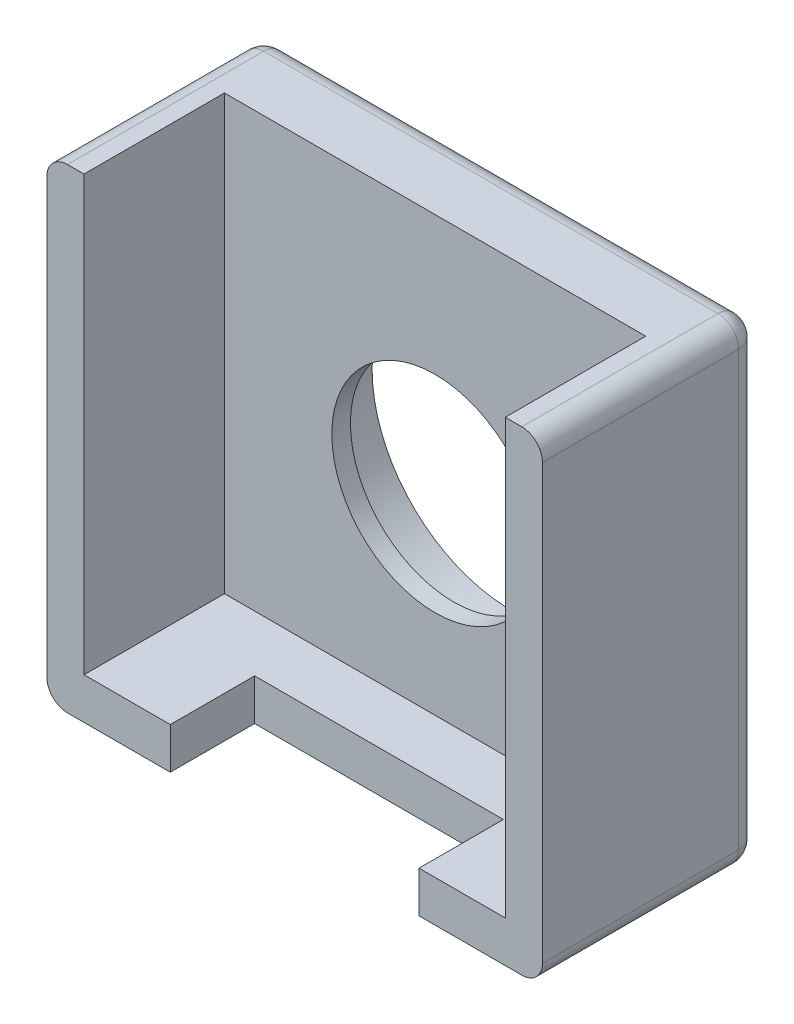
ISO-10303-21;
HEADER;
FILE_DESCRIPTION(('STEP AP214'),'2;1');
FILE_NAME('part.step','',(''),(''),'','','');
FILE_SCHEMA(('AUTOMOTIVE_DESIGN { 1 0 10303 214 1 1 1 1 }'));
ENDSEC;
DATA;
#1=APPLICATION_CONTEXT('core data for automotive mechanical design processes');
#2=APPLICATION_PROTOCOL_DEFINITION('international standard','automotive_design',2000,#1);
#3=PRODUCT_CONTEXT('',#1,'mechanical');
#4=PRODUCT('Part','Part','',(#3));
#5=PRODUCT_RELATED_PRODUCT_CATEGORY('part','',(#4));
#6=PRODUCT_DEFINITION_FORMATION('','',#4);
#7=PRODUCT_DEFINITION_CONTEXT('part definition',#1,'design');
#8=PRODUCT_DEFINITION('design','',#6,#7);
#9=PRODUCT_DEFINITION_SHAPE('','',#8);
#10=(LENGTH_UNIT() NAMED_UNIT(*) SI_UNIT(.MILLI.,.METRE.));
#11=(NAMED_UNIT(*) PLANE_ANGLE_UNIT() SI_UNIT($,.RADIAN.));
#12=(NAMED_UNIT(*) SI_UNIT($,.STERADIAN.) SOLID_ANGLE_UNIT());
#13=UNCERTAINTY_MEASURE_WITH_UNIT(LENGTH_MEASURE(1.E-05),#10,'distance_accuracy_value','');
#14=(GEOMETRIC_REPRESENTATION_CONTEXT(3) GLOBAL_UNCERTAINTY_ASSIGNED_CONTEXT((#13)) GLOBAL_UNIT_ASSIGNED_CONTEXT((#10,
#11,#12)) REPRESENTATION_CONTEXT('',''));
#15=CARTESIAN_POINT('',(0.,0.,0.));
#16=DIRECTION('',(0.,0.,1.));
#17=DIRECTION('',(1.,0.,0.));
#18=AXIS2_PLACEMENT_3D('',#15,#16,#17);
#19=CARTESIAN_POINT('',(0.,0.,0.));
#20=DIRECTION('',(0.,0.,-1.));
#21=DIRECTION('',(-1.,0.,0.));
#22=AXIS2_PLACEMENT_3D('',#19,#20,#21);
#23=PLANE('',#22);
#24=DIRECTION('',(0.,1.,0.));
#25=VECTOR('',#24,1.);
#26=CARTESIAN_POINT('',(24.,0.,0.));
#27=LINE('',#26,#25);
#28=CARTESIAN_POINT('',(24.,1.,0.));
#29=VERTEX_POINT('',#28);
#30=CARTESIAN_POINT('',(24.,22.,0.));
#31=VERTEX_POINT('',#30);
#32=EDGE_CURVE('E291',#29,#31,#27,.T.);
#33=ORIENTED_EDGE('',*,*,#32,.T.);
#34=CARTESIAN_POINT('',(23.,22.,0.));
#35=DIRECTION('',(0.,0.,-1.));
#36=DIRECTION('',(-1.,0.,0.));
#37=AXIS2_PLACEMENT_3D('',#34,#35,#36);
#38=CIRCLE('',#37,1.);
#39=CARTESIAN_POINT('',(23.,23.,0.));
#40=VERTEX_POINT('',#39);
#41=EDGE_CURVE('E272',#31,#40,#38,.F.);
#42=ORIENTED_EDGE('',*,*,#41,.T.);
#43=DIRECTION('',(1.,0.,0.));
#44=VECTOR('',#43,1.);
#45=CARTESIAN_POINT('',(0.,23.,0.));
#46=LINE('',#45,#44);
#47=CARTESIAN_POINT('',(22.2,23.,0.));
#48=VERTEX_POINT('',#47);
#49=EDGE_CURVE('E252',#48,#40,#46,.T.);
#50=ORIENTED_EDGE('',*,*,#49,.F.);
#51=DIRECTION('',(0.,1.,0.));
#52=VECTOR('',#51,1.);
#53=CARTESIAN_POINT('',(22.2,2.,0.));
#54=LINE('',#53,#52);
#55=CARTESIAN_POINT('',(22.2,2.,0.));
#56=VERTEX_POINT('',#55);
#57=EDGE_CURVE('E374',#56,#48,#54,.T.);
#58=ORIENTED_EDGE('',*,*,#57,.F.);
#59=DIRECTION('',(1.,0.,0.));
#60=VECTOR('',#59,1.);
#61=CARTESIAN_POINT('',(22.2,2.,0.));
#62=LINE('',#61,#60);
#63=CARTESIAN_POINT('',(18.0230350343251,2.,0.));
#64=VERTEX_POINT('',#63);
#65=EDGE_CURVE('E242',#64,#56,#62,.T.);
#66=ORIENTED_EDGE('',*,*,#65,.F.);
#67=DIRECTION('',(0.,1.,0.));
#68=VECTOR('',#67,1.);
#69=CARTESIAN_POINT('',(18.0230350343251,23.0011030776407,0.));
#70=LINE('',#69,#68);
#71=CARTESIAN_POINT('',(18.0230350343251,0.,0.));
#72=VERTEX_POINT('',#71);
#73=EDGE_CURVE('E225',#72,#64,#70,.T.);
#74=ORIENTED_EDGE('',*,*,#73,.F.);
#75=DIRECTION('',(1.,0.,0.));
#76=VECTOR('',#75,1.);
#77=CARTESIAN_POINT('',(0.,0.,0.));
#78=LINE('',#77,#76);
#79=CARTESIAN_POINT('',(23.,0.,0.));
#80=VERTEX_POINT('',#79);
#81=EDGE_CURVE('E239',#72,#80,#78,.T.);
#82=ORIENTED_EDGE('',*,*,#81,.T.);
#83=CARTESIAN_POINT('',(23.,1.,0.));
#84=DIRECTION('',(0.,0.,-1.));
#85=DIRECTION('',(-1.,0.,0.));
#86=AXIS2_PLACEMENT_3D('',#83,#84,#85);
#87=CIRCLE('',#86,1.);
#88=EDGE_CURVE('E423',#80,#29,#87,.F.);
#89=ORIENTED_EDGE('',*,*,#88,.T.);
#90=EDGE_LOOP('',(#33,#42,#50,#58,#66,#74,#82,#89));
#91=FACE_BOUND('',#90,.T.);
#92=ADVANCED_FACE('F97',(#91),#23,.F.);
#93=CARTESIAN_POINT('',(24.,0.,0.));
#94=DIRECTION('',(1.,0.,0.));
#95=DIRECTION('',(0.,0.,-1.));
#96=AXIS2_PLACEMENT_3D('',#93,#94,#95);
#97=PLANE('',#96);
#98=DIRECTION('',(0.,1.,0.));
#99=VECTOR('',#98,1.);
#100=CARTESIAN_POINT('',(24.,0.,-9.5));
#101=LINE('',#100,#99);
#102=CARTESIAN_POINT('',(24.,1.,-9.5));
#103=VERTEX_POINT('',#102);
#104=CARTESIAN_POINT('',(24.,22.,-9.5));
#105=VERTEX_POINT('',#104);
#106=EDGE_CURVE('E411',#103,#105,#101,.T.);
#107=ORIENTED_EDGE('',*,*,#106,.T.);
#108=DIRECTION('',(0.,0.,-1.));
#109=VECTOR('',#108,1.);
#110=CARTESIAN_POINT('',(24.,22.,0.));
#111=LINE('',#110,#109);
#112=EDGE_CURVE('E422',#105,#31,#111,.F.);
#113=ORIENTED_EDGE('',*,*,#112,.T.);
#114=ORIENTED_EDGE('',*,*,#32,.F.);
#115=DIRECTION('',(0.,0.,-1.));
#116=VECTOR('',#115,1.);
#117=CARTESIAN_POINT('',(24.,1.,0.));
#118=LINE('',#117,#116);
#119=EDGE_CURVE('E414',#29,#103,#118,.T.);
#120=ORIENTED_EDGE('',*,*,#119,.T.);
#121=EDGE_LOOP('',(#107,#113,#114,#120));
#122=FACE_BOUND('',#121,.T.);
#123=ADVANCED_FACE('F427',(#122),#97,.T.);
#124=CARTESIAN_POINT('',(0.,0.,0.));
#125=DIRECTION('',(1.,0.,0.));
#126=DIRECTION('',(0.,0.,-1.));
#127=AXIS2_PLACEMENT_3D('',#124,#125,#126);
#128=PLANE('',#127);
#129=DIRECTION('',(0.,1.,0.));
#130=VECTOR('',#129,1.);
#131=CARTESIAN_POINT('',(0.,0.,-9.5));
#132=LINE('',#131,#130);
#133=CARTESIAN_POINT('',(0.,22.,-9.5));
#134=VERTEX_POINT('',#133);
#135=CARTESIAN_POINT('',(0.,1.,-9.5));
#136=VERTEX_POINT('',#135);
#137=EDGE_CURVE('E114',#134,#136,#132,.F.);
#138=ORIENTED_EDGE('',*,*,#137,.T.);
#139=DIRECTION('',(0.,0.,-1.));
#140=VECTOR('',#139,1.);
#141=CARTESIAN_POINT('',(0.,1.,0.));
#142=LINE('',#141,#140);
#143=CARTESIAN_POINT('',(0.,1.,0.));
#144=VERTEX_POINT('',#143);
#145=EDGE_CURVE('E294',#136,#144,#142,.F.);
#146=ORIENTED_EDGE('',*,*,#145,.T.);
#147=DIRECTION('',(0.,1.,0.));
#148=VECTOR('',#147,1.);
#149=CARTESIAN_POINT('',(0.,0.,0.));
#150=LINE('',#149,#148);
#151=CARTESIAN_POINT('',(0.,22.,0.));
#152=VERTEX_POINT('',#151);
#153=EDGE_CURVE('E288',#144,#152,#150,.T.);
#154=ORIENTED_EDGE('',*,*,#153,.T.);
#155=DIRECTION('',(0.,0.,-1.));
#156=VECTOR('',#155,1.);
#157=CARTESIAN_POINT('',(0.,22.,0.));
#158=LINE('',#157,#156);
#159=EDGE_CURVE('E119',#152,#134,#158,.T.);
#160=ORIENTED_EDGE('',*,*,#159,.T.);
#161=EDGE_LOOP('',(#138,#146,#154,#160));
#162=FACE_BOUND('',#161,.T.);
#163=ADVANCED_FACE('F466',(#162),#128,.F.);
#164=CARTESIAN_POINT('',(0.,0.,0.));
#165=DIRECTION('',(0.,-1.,0.));
#166=DIRECTION('',(0.,0.,-1.));
#167=AXIS2_PLACEMENT_3D('',#164,#165,#166);
#168=PLANE('',#167);
#169=DIRECTION('',(1.,0.,0.));
#170=VECTOR('',#169,1.);
#171=CARTESIAN_POINT('',(0.,0.,-9.5));
#172=LINE('',#171,#170);
#173=CARTESIAN_POINT('',(1.,0.,-9.5));
#174=VERTEX_POINT('',#173);
#175=CARTESIAN_POINT('',(23.,0.,-9.5));
#176=VERTEX_POINT('',#175);
#177=EDGE_CURVE('E276',#174,#176,#172,.T.);
#178=ORIENTED_EDGE('',*,*,#177,.T.);
#179=DIRECTION('',(0.,0.,-1.));
#180=VECTOR('',#179,1.);
#181=CARTESIAN_POINT('',(23.,0.,0.));
#182=LINE('',#181,#180);
#183=EDGE_CURVE('E248',#176,#80,#182,.F.);
#184=ORIENTED_EDGE('',*,*,#183,.T.);
#185=ORIENTED_EDGE('',*,*,#81,.F.);
#186=DIRECTION('',(0.,0.,1.));
#187=VECTOR('',#186,1.);
#188=CARTESIAN_POINT('',(18.0230350343251,0.,4.08306176034046));
#189=LINE('',#188,#187);
#190=CARTESIAN_POINT('',(18.0230350343251,0.,-4.08306176034046));
#191=VERTEX_POINT('',#190);
#192=EDGE_CURVE('E221',#191,#72,#189,.T.);
#193=ORIENTED_EDGE('',*,*,#192,.F.);
#194=DIRECTION('',(1.,0.,0.));
#195=VECTOR('',#194,1.);
#196=CARTESIAN_POINT('',(5.97696496567488,0.,-4.08306176034046));
#197=LINE('',#196,#195);
#198=CARTESIAN_POINT('',(5.97696496567488,0.,-4.08306176034046));
#199=VERTEX_POINT('',#198);
#200=EDGE_CURVE('E346',#199,#191,#197,.T.);
#201=ORIENTED_EDGE('',*,*,#200,.F.);
#202=DIRECTION('',(0.,0.,-1.));
#203=VECTOR('',#202,1.);
#204=CARTESIAN_POINT('',(5.97696496567488,0.,4.08306176034046));
#205=LINE('',#204,#203);
#206=CARTESIAN_POINT('',(5.97696496567488,0.,0.));
#207=VERTEX_POINT('',#206);
#208=EDGE_CURVE('E232',#207,#199,#205,.T.);
#209=ORIENTED_EDGE('',*,*,#208,.F.);
#210=CARTESIAN_POINT('',(1.,0.,0.));
#211=VERTEX_POINT('',#210);
#212=EDGE_CURVE('E249',#211,#207,#78,.T.);
#213=ORIENTED_EDGE('',*,*,#212,.F.);
#214=DIRECTION('',(0.,0.,-1.));
#215=VECTOR('',#214,1.);
#216=CARTESIAN_POINT('',(1.,0.,-10.5));
#217=LINE('',#216,#215);
#218=EDGE_CURVE('E274',#211,#174,#217,.T.);
#219=ORIENTED_EDGE('',*,*,#218,.T.);
#220=EDGE_LOOP('',(#178,#184,#185,#193,#201,#209,#213,#219));
#221=FACE_BOUND('',#220,.T.);
#222=ADVANCED_FACE('F246',(#221),#168,.T.);
#223=CARTESIAN_POINT('',(0.,0.,-10.5));
#224=DIRECTION('',(0.,0.,-1.));
#225=DIRECTION('',(-1.,0.,0.));
#226=AXIS2_PLACEMENT_3D('',#223,#224,#225);
#227=PLANE('',#226);
#228=CARTESIAN_POINT('',(12.,11.3,-10.5));
#229=DIRECTION('',(0.,0.,1.));
#230=DIRECTION('',(1.,0.,0.));
#231=AXIS2_PLACEMENT_3D('',#228,#229,#230);
#232=CIRCLE('',#231,6.75);
#233=CARTESIAN_POINT('',(18.75,11.3,-10.5));
#234=VERTEX_POINT('',#233);
#235=EDGE_CURVE('E527',#234,#234,#232,.T.);
#236=ORIENTED_EDGE('',*,*,#235,.T.);
#237=EDGE_LOOP('',(#236));
#238=FACE_BOUND('',#237,.T.);
#239=DIRECTION('',(1.,0.,0.));
#240=VECTOR('',#239,1.);
#241=CARTESIAN_POINT('',(24.,22.,-10.5));
#242=LINE('',#241,#240);
#243=CARTESIAN_POINT('',(1.,22.,-10.5));
#244=VERTEX_POINT('',#243);
#245=CARTESIAN_POINT('',(23.,22.,-10.5));
#246=VERTEX_POINT('',#245);
#247=EDGE_CURVE('E279',#244,#246,#242,.T.);
#248=ORIENTED_EDGE('',*,*,#247,.T.);
#249=DIRECTION('',(0.,1.,0.));
#250=VECTOR('',#249,1.);
#251=CARTESIAN_POINT('',(23.,0.,-10.5));
#252=LINE('',#251,#250);
#253=CARTESIAN_POINT('',(23.,1.,-10.5));
#254=VERTEX_POINT('',#253);
#255=EDGE_CURVE('E285',#246,#254,#252,.F.);
#256=ORIENTED_EDGE('',*,*,#255,.T.);
#257=DIRECTION('',(1.,0.,0.));
#258=VECTOR('',#257,1.);
#259=CARTESIAN_POINT('',(0.,1.,-10.5));
#260=LINE('',#259,#258);
#261=CARTESIAN_POINT('',(1.,1.,-10.5));
#262=VERTEX_POINT('',#261);
#263=EDGE_CURVE('E283',#254,#262,#260,.F.);
#264=ORIENTED_EDGE('',*,*,#263,.T.);
#265=DIRECTION('',(0.,1.,0.));
#266=VECTOR('',#265,1.);
#267=CARTESIAN_POINT('',(1.,23.,-10.5));
#268=LINE('',#267,#266);
#269=EDGE_CURVE('E281',#262,#244,#268,.T.);
#270=ORIENTED_EDGE('',*,*,#269,.T.);
#271=EDGE_LOOP('',(#248,#256,#264,#270));
#272=FACE_BOUND('',#271,.T.);
#273=ADVANCED_FACE('F473',(#238,#272),#227,.T.);
#274=ORIENTED_EDGE('',*,*,#153,.F.);
#275=CARTESIAN_POINT('',(1.,1.,0.));
#276=DIRECTION('',(0.,0.,-1.));
#277=DIRECTION('',(-1.,0.,0.));
#278=AXIS2_PLACEMENT_3D('',#275,#276,#277);
#279=CIRCLE('',#278,1.);
#280=EDGE_CURVE('E12',#144,#211,#279,.F.);
#281=ORIENTED_EDGE('',*,*,#280,.T.);
#282=ORIENTED_EDGE('',*,*,#212,.T.);
#283=DIRECTION('',(0.,-1.,0.));
#284=VECTOR('',#283,1.);
#285=CARTESIAN_POINT('',(5.97696496567488,23.0011030776407,0.));
#286=LINE('',#285,#284);
#287=CARTESIAN_POINT('',(5.97696496567488,2.,0.));
#288=VERTEX_POINT('',#287);
#289=EDGE_CURVE('E244',#288,#207,#286,.T.);
#290=ORIENTED_EDGE('',*,*,#289,.F.);
#291=CARTESIAN_POINT('',(1.8,2.,0.));
#292=VERTEX_POINT('',#291);
#293=EDGE_CURVE('E358',#292,#288,#62,.T.);
#294=ORIENTED_EDGE('',*,*,#293,.F.);
#295=DIRECTION('',(0.,1.,0.));
#296=VECTOR('',#295,1.);
#297=CARTESIAN_POINT('',(1.8,2.,0.));
#298=LINE('',#297,#296);
#299=CARTESIAN_POINT('',(1.8,23.,0.));
#300=VERTEX_POINT('',#299);
#301=EDGE_CURVE('E266',#292,#300,#298,.T.);
#302=ORIENTED_EDGE('',*,*,#301,.T.);
#303=CARTESIAN_POINT('',(1.,23.,0.));
#304=VERTEX_POINT('',#303);
#305=EDGE_CURVE('E261',#304,#300,#46,.T.);
#306=ORIENTED_EDGE('',*,*,#305,.F.);
#307=CARTESIAN_POINT('',(1.,22.,0.));
#308=DIRECTION('',(0.,0.,-1.));
#309=DIRECTION('',(-1.,0.,0.));
#310=AXIS2_PLACEMENT_3D('',#307,#308,#309);
#311=CIRCLE('',#310,1.);
#312=EDGE_CURVE('E106',#304,#152,#311,.F.);
#313=ORIENTED_EDGE('',*,*,#312,.T.);
#314=EDGE_LOOP('',(#274,#281,#282,#290,#294,#302,#306,#313));
#315=FACE_BOUND('',#314,.T.);
#316=ADVANCED_FACE('F383',(#315),#23,.F.);
#317=CARTESIAN_POINT('',(0.,23.,0.));
#318=DIRECTION('',(0.,-1.,0.));
#319=DIRECTION('',(0.,0.,-1.));
#320=AXIS2_PLACEMENT_3D('',#317,#318,#319);
#321=PLANE('',#320);
#322=ORIENTED_EDGE('',*,*,#49,.T.);
#323=DIRECTION('',(0.,0.,-1.));
#324=VECTOR('',#323,1.);
#325=CARTESIAN_POINT('',(23.,23.,-10.5));
#326=LINE('',#325,#324);
#327=CARTESIAN_POINT('',(23.,23.,-9.5));
#328=VERTEX_POINT('',#327);
#329=EDGE_CURVE('E405',#40,#328,#326,.T.);
#330=ORIENTED_EDGE('',*,*,#329,.T.);
#331=DIRECTION('',(1.,0.,0.));
#332=VECTOR('',#331,1.);
#333=CARTESIAN_POINT('',(0.,23.,-9.5));
#334=LINE('',#333,#332);
#335=CARTESIAN_POINT('',(1.,23.,-9.5));
#336=VERTEX_POINT('',#335);
#337=EDGE_CURVE('E412',#328,#336,#334,.F.);
#338=ORIENTED_EDGE('',*,*,#337,.T.);
#339=DIRECTION('',(0.,0.,-1.));
#340=VECTOR('',#339,1.);
#341=CARTESIAN_POINT('',(1.,23.,0.));
#342=LINE('',#341,#340);
#343=EDGE_CURVE('E290',#336,#304,#342,.F.);
#344=ORIENTED_EDGE('',*,*,#343,.T.);
#345=ORIENTED_EDGE('',*,*,#305,.T.);
#346=DIRECTION('',(0.,0.,1.));
#347=VECTOR('',#346,1.);
#348=CARTESIAN_POINT('',(1.8,23.,-6.8));
#349=LINE('',#348,#347);
#350=CARTESIAN_POINT('',(1.8,23.,-6.8));
#351=VERTEX_POINT('',#350);
#352=EDGE_CURVE('E353',#351,#300,#349,.T.);
#353=ORIENTED_EDGE('',*,*,#352,.F.);
#354=DIRECTION('',(-1.,0.,0.));
#355=VECTOR('',#354,1.);
#356=CARTESIAN_POINT('',(22.2,23.,-6.8));
#357=LINE('',#356,#355);
#358=CARTESIAN_POINT('',(22.2,23.,-6.8));
#359=VERTEX_POINT('',#358);
#360=EDGE_CURVE('E357',#359,#351,#357,.T.);
#361=ORIENTED_EDGE('',*,*,#360,.F.);
#362=DIRECTION('',(0.,0.,-1.));
#363=VECTOR('',#362,1.);
#364=CARTESIAN_POINT('',(22.2,23.,-6.8));
#365=LINE('',#364,#363);
#366=EDGE_CURVE('E369',#48,#359,#365,.T.);
#367=ORIENTED_EDGE('',*,*,#366,.F.);
#368=EDGE_LOOP('',(#322,#330,#338,#344,#345,#353,#361,#367));
#369=FACE_BOUND('',#368,.T.);
#370=ADVANCED_FACE('F399',(#369),#321,.F.);
#371=CARTESIAN_POINT('',(1.8,2.,-6.8));
#372=DIRECTION('',(-1.,0.,0.));
#373=DIRECTION('',(0.,0.,1.));
#374=AXIS2_PLACEMENT_3D('',#371,#372,#373);
#375=PLANE('',#374);
#376=ORIENTED_EDGE('',*,*,#352,.T.);
#377=ORIENTED_EDGE('',*,*,#301,.F.);
#378=DIRECTION('',(0.,0.,1.));
#379=VECTOR('',#378,1.);
#380=CARTESIAN_POINT('',(1.8,2.,-6.8));
#381=LINE('',#380,#379);
#382=CARTESIAN_POINT('',(1.8,2.,-6.8));
#383=VERTEX_POINT('',#382);
#384=EDGE_CURVE('E354',#383,#292,#381,.T.);
#385=ORIENTED_EDGE('',*,*,#384,.F.);
#386=DIRECTION('',(0.,1.,0.));
#387=VECTOR('',#386,1.);
#388=CARTESIAN_POINT('',(1.8,2.,-6.8));
#389=LINE('',#388,#387);
#390=EDGE_CURVE('E250',#383,#351,#389,.T.);
#391=ORIENTED_EDGE('',*,*,#390,.T.);
#392=EDGE_LOOP('',(#376,#377,#385,#391));
#393=FACE_BOUND('',#392,.T.);
#394=ADVANCED_FACE('F387',(#393),#375,.F.);
#395=CARTESIAN_POINT('',(22.2,2.,-6.8));
#396=DIRECTION('',(0.,0.,-1.));
#397=DIRECTION('',(-1.,0.,0.));
#398=AXIS2_PLACEMENT_3D('',#395,#396,#397);
#399=PLANE('',#398);
#400=CARTESIAN_POINT('',(12.,11.3,-6.8));
#401=DIRECTION('',(0.,0.,-1.));
#402=DIRECTION('',(-1.,0.,0.));
#403=AXIS2_PLACEMENT_3D('',#400,#401,#402);
#404=CIRCLE('',#403,5.);
#405=CARTESIAN_POINT('',(7.,11.3,-6.8));
#406=VERTEX_POINT('',#405);
#407=EDGE_CURVE('E526',#406,#406,#404,.F.);
#408=ORIENTED_EDGE('',*,*,#407,.F.);
#409=EDGE_LOOP('',(#408));
#410=FACE_BOUND('',#409,.T.);
#411=ORIENTED_EDGE('',*,*,#360,.T.);
#412=ORIENTED_EDGE('',*,*,#390,.F.);
#413=DIRECTION('',(-1.,0.,0.));
#414=VECTOR('',#413,1.);
#415=CARTESIAN_POINT('',(22.2,2.,-6.8));
#416=LINE('',#415,#414);
#417=CARTESIAN_POINT('',(22.2,2.,-6.8));
#418=VERTEX_POINT('',#417);
#419=EDGE_CURVE('E364',#418,#383,#416,.T.);
#420=ORIENTED_EDGE('',*,*,#419,.F.);
#421=DIRECTION('',(0.,1.,0.));
#422=VECTOR('',#421,1.);
#423=CARTESIAN_POINT('',(22.2,2.,-6.8));
#424=LINE('',#423,#422);
#425=EDGE_CURVE('E254',#418,#359,#424,.T.);
#426=ORIENTED_EDGE('',*,*,#425,.T.);
#427=EDGE_LOOP('',(#411,#412,#420,#426));
#428=FACE_BOUND('',#427,.T.);
#429=ADVANCED_FACE('F395',(#410,#428),#399,.F.);
#430=CARTESIAN_POINT('',(22.2,2.,-6.8));
#431=DIRECTION('',(1.,0.,0.));
#432=DIRECTION('',(0.,0.,-1.));
#433=AXIS2_PLACEMENT_3D('',#430,#431,#432);
#434=PLANE('',#433);
#435=ORIENTED_EDGE('',*,*,#366,.T.);
#436=ORIENTED_EDGE('',*,*,#425,.F.);
#437=DIRECTION('',(0.,0.,-1.));
#438=VECTOR('',#437,1.);
#439=CARTESIAN_POINT('',(22.2,2.,-6.8));
#440=LINE('',#439,#438);
#441=EDGE_CURVE('E361',#56,#418,#440,.T.);
#442=ORIENTED_EDGE('',*,*,#441,.F.);
#443=ORIENTED_EDGE('',*,*,#57,.T.);
#444=EDGE_LOOP('',(#435,#436,#442,#443));
#445=FACE_BOUND('',#444,.T.);
#446=ADVANCED_FACE('F491',(#445),#434,.F.);
#447=CARTESIAN_POINT('',(0.,2.,0.));
#448=DIRECTION('',(0.,-1.,0.));
#449=DIRECTION('',(0.,0.,-1.));
#450=AXIS2_PLACEMENT_3D('',#447,#448,#449);
#451=PLANE('',#450);
#452=DIRECTION('',(-1.,0.,0.));
#453=VECTOR('',#452,1.);
#454=CARTESIAN_POINT('',(5.97696496567488,2.,-4.08306176034046));
#455=LINE('',#454,#453);
#456=CARTESIAN_POINT('',(18.0230350343251,2.,-4.08306176034046));
#457=VERTEX_POINT('',#456);
#458=CARTESIAN_POINT('',(5.97696496567488,2.,-4.08306176034046));
#459=VERTEX_POINT('',#458);
#460=EDGE_CURVE('E243',#457,#459,#455,.T.);
#461=ORIENTED_EDGE('',*,*,#460,.F.);
#462=DIRECTION('',(0.,0.,-1.));
#463=VECTOR('',#462,1.);
#464=CARTESIAN_POINT('',(18.0230350343251,2.,4.08306176034046));
#465=LINE('',#464,#463);
#466=EDGE_CURVE('E233',#64,#457,#465,.T.);
#467=ORIENTED_EDGE('',*,*,#466,.F.);
#468=ORIENTED_EDGE('',*,*,#65,.T.);
#469=ORIENTED_EDGE('',*,*,#441,.T.);
#470=ORIENTED_EDGE('',*,*,#419,.T.);
#471=ORIENTED_EDGE('',*,*,#384,.T.);
#472=ORIENTED_EDGE('',*,*,#293,.T.);
#473=DIRECTION('',(0.,0.,1.));
#474=VECTOR('',#473,1.);
#475=CARTESIAN_POINT('',(5.97696496567488,2.,4.08306176034046));
#476=LINE('',#475,#474);
#477=EDGE_CURVE('E350',#459,#288,#476,.T.);
#478=ORIENTED_EDGE('',*,*,#477,.F.);
#479=EDGE_LOOP('',(#461,#467,#468,#469,#470,#471,#472,#478));
#480=FACE_BOUND('',#479,.T.);
#481=ADVANCED_FACE('F391',(#480),#451,.F.);
#482=CARTESIAN_POINT('',(18.0230350343251,23.0011030776407,4.08306176034046));
#483=DIRECTION('',(1.,0.,0.));
#484=DIRECTION('',(0.,0.,-1.));
#485=AXIS2_PLACEMENT_3D('',#482,#483,#484);
#486=PLANE('',#485);
#487=ORIENTED_EDGE('',*,*,#73,.T.);
#488=ORIENTED_EDGE('',*,*,#466,.T.);
#489=DIRECTION('',(0.,-1.,0.));
#490=VECTOR('',#489,1.);
#491=CARTESIAN_POINT('',(18.0230350343251,23.0011030776407,-4.08306176034046));
#492=LINE('',#491,#490);
#493=EDGE_CURVE('E227',#457,#191,#492,.T.);
#494=ORIENTED_EDGE('',*,*,#493,.T.);
#495=ORIENTED_EDGE('',*,*,#192,.T.);
#496=EDGE_LOOP('',(#487,#488,#494,#495));
#497=FACE_BOUND('',#496,.T.);
#498=ADVANCED_FACE('F223',(#497),#486,.F.);
#499=CARTESIAN_POINT('',(5.97696496567488,23.0011030776407,-4.08306176034046));
#500=DIRECTION('',(0.,0.,-1.));
#501=DIRECTION('',(-1.,0.,0.));
#502=AXIS2_PLACEMENT_3D('',#499,#500,#501);
#503=PLANE('',#502);
#504=ORIENTED_EDGE('',*,*,#460,.T.);
#505=DIRECTION('',(0.,-1.,0.));
#506=VECTOR('',#505,1.);
#507=CARTESIAN_POINT('',(5.97696496567488,23.0011030776407,-4.08306176034046));
#508=LINE('',#507,#506);
#509=EDGE_CURVE('E348',#459,#199,#508,.T.);
#510=ORIENTED_EDGE('',*,*,#509,.T.);
#511=ORIENTED_EDGE('',*,*,#200,.T.);
#512=ORIENTED_EDGE('',*,*,#493,.F.);
#513=EDGE_LOOP('',(#504,#510,#511,#512));
#514=FACE_BOUND('',#513,.T.);
#515=ADVANCED_FACE('F501',(#514),#503,.F.);
#516=CARTESIAN_POINT('',(5.97696496567488,23.0011030776407,4.08306176034046));
#517=DIRECTION('',(-1.,0.,0.));
#518=DIRECTION('',(0.,0.,1.));
#519=AXIS2_PLACEMENT_3D('',#516,#517,#518);
#520=PLANE('',#519);
#521=ORIENTED_EDGE('',*,*,#289,.T.);
#522=ORIENTED_EDGE('',*,*,#208,.T.);
#523=ORIENTED_EDGE('',*,*,#509,.F.);
#524=ORIENTED_EDGE('',*,*,#477,.T.);
#525=EDGE_LOOP('',(#521,#522,#523,#524));
#526=FACE_BOUND('',#525,.T.);
#527=ADVANCED_FACE('F502',(#526),#520,.F.);
#528=CARTESIAN_POINT('',(1.,1.,0.));
#529=DIRECTION('',(0.,0.,1.));
#530=DIRECTION('',(1.,0.,0.));
#531=AXIS2_PLACEMENT_3D('',#528,#529,#530);
#532=CYLINDRICAL_SURFACE('',#531,1.);
#533=CARTESIAN_POINT('',(1.,1.,-9.5));
#534=DIRECTION('',(0.,0.,-1.));
#535=DIRECTION('',(-1.,0.,0.));
#536=AXIS2_PLACEMENT_3D('',#533,#534,#535);
#537=CIRCLE('',#536,1.);
#538=EDGE_CURVE('E328',#174,#136,#537,.T.);
#539=ORIENTED_EDGE('',*,*,#538,.F.);
#540=ORIENTED_EDGE('',*,*,#218,.F.);
#541=ORIENTED_EDGE('',*,*,#280,.F.);
#542=ORIENTED_EDGE('',*,*,#145,.F.);
#543=EDGE_LOOP('',(#539,#540,#541,#542));
#544=FACE_BOUND('',#543,.T.);
#545=ADVANCED_FACE('F99',(#544),#532,.T.);
#546=CARTESIAN_POINT('',(1.,1.,-9.5));
#547=DIRECTION('',(-1.,0.,0.));
#548=DIRECTION('',(0.,0.,1.));
#549=AXIS2_PLACEMENT_3D('',#546,#547,#548);
#550=SPHERICAL_SURFACE('',#549,1.);
#551=CARTESIAN_POINT('',(1.,1.,-9.5));
#552=DIRECTION('',(-1.,0.,0.));
#553=DIRECTION('',(0.,0.,1.));
#554=AXIS2_PLACEMENT_3D('',#551,#552,#553);
#555=CIRCLE('',#554,1.);
#556=EDGE_CURVE('E323',#174,#262,#555,.F.);
#557=ORIENTED_EDGE('',*,*,#556,.F.);
#558=ORIENTED_EDGE('',*,*,#538,.T.);
#559=CARTESIAN_POINT('',(1.,1.,-9.5));
#560=DIRECTION('',(0.,-1.,0.));
#561=DIRECTION('',(0.,0.,-1.));
#562=AXIS2_PLACEMENT_3D('',#559,#560,#561);
#563=CIRCLE('',#562,1.);
#564=EDGE_CURVE('E326',#262,#136,#563,.F.);
#565=ORIENTED_EDGE('',*,*,#564,.F.);
#566=EDGE_LOOP('',(#557,#558,#565));
#567=FACE_BOUND('',#566,.T.);
#568=ADVANCED_FACE('F458',(#567),#550,.T.);
#569=CARTESIAN_POINT('',(1.,22.,0.));
#570=DIRECTION('',(0.,0.,-1.));
#571=DIRECTION('',(-1.,0.,0.));
#572=AXIS2_PLACEMENT_3D('',#569,#570,#571);
#573=CYLINDRICAL_SURFACE('',#572,1.);
#574=ORIENTED_EDGE('',*,*,#312,.F.);
#575=ORIENTED_EDGE('',*,*,#343,.F.);
#576=CARTESIAN_POINT('',(1.,22.,-9.5));
#577=DIRECTION('',(0.,0.,-1.));
#578=DIRECTION('',(-1.,0.,0.));
#579=AXIS2_PLACEMENT_3D('',#576,#577,#578);
#580=CIRCLE('',#579,1.);
#581=EDGE_CURVE('E320',#134,#336,#580,.T.);
#582=ORIENTED_EDGE('',*,*,#581,.F.);
#583=ORIENTED_EDGE('',*,*,#159,.F.);
#584=EDGE_LOOP('',(#574,#575,#582,#583));
#585=FACE_BOUND('',#584,.T.);
#586=ADVANCED_FACE('F451',(#585),#573,.T.);
#587=CARTESIAN_POINT('',(1.,0.,-9.5));
#588=DIRECTION('',(0.,-1.,0.));
#589=DIRECTION('',(0.,0.,-1.));
#590=AXIS2_PLACEMENT_3D('',#587,#588,#589);
#591=CYLINDRICAL_SURFACE('',#590,1.);
#592=ORIENTED_EDGE('',*,*,#564,.T.);
#593=ORIENTED_EDGE('',*,*,#137,.F.);
#594=CARTESIAN_POINT('',(1.,22.,-9.5));
#595=DIRECTION('',(0.,1.,0.));
#596=DIRECTION('',(0.,0.,1.));
#597=AXIS2_PLACEMENT_3D('',#594,#595,#596);
#598=CIRCLE('',#597,1.);
#599=EDGE_CURVE('E317',#244,#134,#598,.T.);
#600=ORIENTED_EDGE('',*,*,#599,.F.);
#601=ORIENTED_EDGE('',*,*,#269,.F.);
#602=EDGE_LOOP('',(#592,#593,#600,#601));
#603=FACE_BOUND('',#602,.T.);
#604=ADVANCED_FACE('F457',(#603),#591,.T.);
#605=CARTESIAN_POINT('',(0.,1.,-9.5));
#606=DIRECTION('',(1.,0.,0.));
#607=DIRECTION('',(0.,0.,-1.));
#608=AXIS2_PLACEMENT_3D('',#605,#606,#607);
#609=CYLINDRICAL_SURFACE('',#608,1.);
#610=ORIENTED_EDGE('',*,*,#556,.T.);
#611=ORIENTED_EDGE('',*,*,#263,.F.);
#612=CARTESIAN_POINT('',(23.,1.,-9.5));
#613=DIRECTION('',(1.,0.,0.));
#614=DIRECTION('',(0.,0.,-1.));
#615=AXIS2_PLACEMENT_3D('',#612,#613,#614);
#616=CIRCLE('',#615,1.);
#617=EDGE_CURVE('E314',#176,#254,#616,.T.);
#618=ORIENTED_EDGE('',*,*,#617,.F.);
#619=ORIENTED_EDGE('',*,*,#177,.F.);
#620=EDGE_LOOP('',(#610,#611,#618,#619));
#621=FACE_BOUND('',#620,.T.);
#622=ADVANCED_FACE('F461',(#621),#609,.T.);
#623=CARTESIAN_POINT('',(23.,1.,0.));
#624=DIRECTION('',(0.,0.,-1.));
#625=DIRECTION('',(-1.,0.,0.));
#626=AXIS2_PLACEMENT_3D('',#623,#624,#625);
#627=CYLINDRICAL_SURFACE('',#626,1.);
#628=ORIENTED_EDGE('',*,*,#88,.F.);
#629=ORIENTED_EDGE('',*,*,#183,.F.);
#630=CARTESIAN_POINT('',(23.,1.,-9.5));
#631=DIRECTION('',(0.,0.,-1.));
#632=DIRECTION('',(-1.,0.,0.));
#633=AXIS2_PLACEMENT_3D('',#630,#631,#632);
#634=CIRCLE('',#633,1.);
#635=EDGE_CURVE('E311',#103,#176,#634,.T.);
#636=ORIENTED_EDGE('',*,*,#635,.F.);
#637=ORIENTED_EDGE('',*,*,#119,.F.);
#638=EDGE_LOOP('',(#628,#629,#636,#637));
#639=FACE_BOUND('',#638,.T.);
#640=ADVANCED_FACE('F430',(#639),#627,.T.);
#641=CARTESIAN_POINT('',(1.,22.,-9.5));
#642=DIRECTION('',(-1.,0.,0.));
#643=DIRECTION('',(0.,0.,1.));
#644=AXIS2_PLACEMENT_3D('',#641,#642,#643);
#645=SPHERICAL_SURFACE('',#644,1.);
#646=ORIENTED_EDGE('',*,*,#599,.T.);
#647=ORIENTED_EDGE('',*,*,#581,.T.);
#648=CARTESIAN_POINT('',(1.,22.,-9.5));
#649=DIRECTION('',(-1.,0.,0.));
#650=DIRECTION('',(0.,0.,1.));
#651=AXIS2_PLACEMENT_3D('',#648,#649,#650);
#652=CIRCLE('',#651,1.);
#653=EDGE_CURVE('E308',#244,#336,#652,.F.);
#654=ORIENTED_EDGE('',*,*,#653,.F.);
#655=EDGE_LOOP('',(#646,#647,#654));
#656=FACE_BOUND('',#655,.T.);
#657=ADVANCED_FACE('F453',(#656),#645,.T.);
#658=CARTESIAN_POINT('',(23.,1.,-9.5));
#659=DIRECTION('',(0.,-1.,0.));
#660=DIRECTION('',(0.,0.,-1.));
#661=AXIS2_PLACEMENT_3D('',#658,#659,#660);
#662=SPHERICAL_SURFACE('',#661,1.);
#663=ORIENTED_EDGE('',*,*,#635,.T.);
#664=ORIENTED_EDGE('',*,*,#617,.T.);
#665=CARTESIAN_POINT('',(23.,1.,-9.5));
#666=DIRECTION('',(0.,-1.,0.));
#667=DIRECTION('',(0.,0.,-1.));
#668=AXIS2_PLACEMENT_3D('',#665,#666,#667);
#669=CIRCLE('',#668,1.);
#670=EDGE_CURVE('E306',#103,#254,#669,.F.);
#671=ORIENTED_EDGE('',*,*,#670,.F.);
#672=EDGE_LOOP('',(#663,#664,#671));
#673=FACE_BOUND('',#672,.T.);
#674=ADVANCED_FACE('F435',(#673),#662,.T.);
#675=CARTESIAN_POINT('',(0.,22.,-9.5));
#676=DIRECTION('',(-1.,0.,0.));
#677=DIRECTION('',(0.,0.,1.));
#678=AXIS2_PLACEMENT_3D('',#675,#676,#677);
#679=CYLINDRICAL_SURFACE('',#678,1.);
#680=ORIENTED_EDGE('',*,*,#653,.T.);
#681=ORIENTED_EDGE('',*,*,#337,.F.);
#682=CARTESIAN_POINT('',(23.,22.,-9.5));
#683=DIRECTION('',(1.,0.,0.));
#684=DIRECTION('',(0.,0.,-1.));
#685=AXIS2_PLACEMENT_3D('',#682,#683,#684);
#686=CIRCLE('',#685,1.);
#687=EDGE_CURVE('E303',#246,#328,#686,.T.);
#688=ORIENTED_EDGE('',*,*,#687,.F.);
#689=ORIENTED_EDGE('',*,*,#247,.F.);
#690=EDGE_LOOP('',(#680,#681,#688,#689));
#691=FACE_BOUND('',#690,.T.);
#692=ADVANCED_FACE('F447',(#691),#679,.T.);
#693=CARTESIAN_POINT('',(23.,0.,-9.5));
#694=DIRECTION('',(0.,1.,0.));
#695=DIRECTION('',(0.,0.,1.));
#696=AXIS2_PLACEMENT_3D('',#693,#694,#695);
#697=CYLINDRICAL_SURFACE('',#696,1.);
#698=ORIENTED_EDGE('',*,*,#670,.T.);
#699=ORIENTED_EDGE('',*,*,#255,.F.);
#700=CARTESIAN_POINT('',(23.,22.,-9.5));
#701=DIRECTION('',(0.,1.,0.));
#702=DIRECTION('',(0.,0.,1.));
#703=AXIS2_PLACEMENT_3D('',#700,#701,#702);
#704=CIRCLE('',#703,1.);
#705=EDGE_CURVE('E299',#105,#246,#704,.T.);
#706=ORIENTED_EDGE('',*,*,#705,.F.);
#707=ORIENTED_EDGE('',*,*,#106,.F.);
#708=EDGE_LOOP('',(#698,#699,#706,#707));
#709=FACE_BOUND('',#708,.T.);
#710=ADVANCED_FACE('F440',(#709),#697,.T.);
#711=CARTESIAN_POINT('',(23.,22.,-9.5));
#712=DIRECTION('',(0.,0.,-1.));
#713=DIRECTION('',(-1.,0.,0.));
#714=AXIS2_PLACEMENT_3D('',#711,#712,#713);
#715=SPHERICAL_SURFACE('',#714,1.);
#716=ORIENTED_EDGE('',*,*,#705,.T.);
#717=ORIENTED_EDGE('',*,*,#687,.T.);
#718=CARTESIAN_POINT('',(23.,22.,-9.5));
#719=DIRECTION('',(0.,0.,-1.));
#720=DIRECTION('',(-1.,0.,0.));
#721=AXIS2_PLACEMENT_3D('',#718,#719,#720);
#722=CIRCLE('',#721,1.);
#723=EDGE_CURVE('E297',#105,#328,#722,.F.);
#724=ORIENTED_EDGE('',*,*,#723,.F.);
#725=EDGE_LOOP('',(#716,#717,#724));
#726=FACE_BOUND('',#725,.T.);
#727=ADVANCED_FACE('F443',(#726),#715,.T.);
#728=CARTESIAN_POINT('',(23.,22.,0.));
#729=DIRECTION('',(0.,0.,1.));
#730=DIRECTION('',(1.,0.,0.));
#731=AXIS2_PLACEMENT_3D('',#728,#729,#730);
#732=CYLINDRICAL_SURFACE('',#731,1.);
#733=ORIENTED_EDGE('',*,*,#41,.F.);
#734=ORIENTED_EDGE('',*,*,#112,.F.);
#735=ORIENTED_EDGE('',*,*,#723,.T.);
#736=ORIENTED_EDGE('',*,*,#329,.F.);
#737=EDGE_LOOP('',(#733,#734,#735,#736));
#738=FACE_BOUND('',#737,.T.);
#739=ADVANCED_FACE('F408',(#738),#732,.T.);
#740=CARTESIAN_POINT('',(0.,0.,-7.7));
#741=DIRECTION('',(0.,0.,1.));
#742=DIRECTION('',(1.,0.,0.));
#743=AXIS2_PLACEMENT_3D('',#740,#741,#742);
#744=PLANE('',#743);
#745=CARTESIAN_POINT('',(12.,11.3,-7.7));
#746=DIRECTION('',(0.,0.,1.));
#747=DIRECTION('',(1.,0.,0.));
#748=AXIS2_PLACEMENT_3D('',#745,#746,#747);
#749=CIRCLE('',#748,5.);
#750=CARTESIAN_POINT('',(17.,11.3,-7.7));
#751=VERTEX_POINT('',#750);
#752=EDGE_CURVE('E101',#751,#751,#749,.F.);
#753=ORIENTED_EDGE('',*,*,#752,.F.);
#754=EDGE_LOOP('',(#753));
#755=FACE_BOUND('',#754,.T.);
#756=CARTESIAN_POINT('',(12.,11.3,-7.7));
#757=DIRECTION('',(0.,0.,1.));
#758=DIRECTION('',(1.,0.,0.));
#759=AXIS2_PLACEMENT_3D('',#756,#757,#758);
#760=CIRCLE('',#759,6.75);
#761=CARTESIAN_POINT('',(18.75,11.3,-7.7));
#762=VERTEX_POINT('',#761);
#763=EDGE_CURVE('E300',#762,#762,#760,.T.);
#764=ORIENTED_EDGE('',*,*,#763,.F.);
#765=EDGE_LOOP('',(#764));
#766=FACE_BOUND('',#765,.T.);
#767=ADVANCED_FACE('F508',(#755,#766),#744,.F.);
#768=CARTESIAN_POINT('',(12.,11.3,-10.5));
#769=DIRECTION('',(0.,0.,1.));
#770=DIRECTION('',(1.,0.,0.));
#771=AXIS2_PLACEMENT_3D('',#768,#769,#770);
#772=CYLINDRICAL_SURFACE('',#771,6.75);
#773=ORIENTED_EDGE('',*,*,#235,.F.);
#774=EDGE_LOOP('',(#773));
#775=FACE_BOUND('',#774,.T.);
#776=ORIENTED_EDGE('',*,*,#763,.T.);
#777=EDGE_LOOP('',(#776));
#778=FACE_BOUND('',#777,.T.);
#779=ADVANCED_FACE('F511',(#775,#778),#772,.F.);
#780=CARTESIAN_POINT('',(12.,11.3,-7.4));
#781=DIRECTION('',(0.,0.,-1.));
#782=DIRECTION('',(-1.,0.,0.));
#783=AXIS2_PLACEMENT_3D('',#780,#781,#782);
#784=CYLINDRICAL_SURFACE('',#783,5.);
#785=ORIENTED_EDGE('',*,*,#752,.T.);
#786=EDGE_LOOP('',(#785));
#787=FACE_BOUND('',#786,.T.);
#788=ORIENTED_EDGE('',*,*,#407,.T.);
#789=EDGE_LOOP('',(#788));
#790=FACE_BOUND('',#789,.T.);
#791=ADVANCED_FACE('F513',(#787,#790),#784,.F.);
#792=CLOSED_SHELL('',(#92,#123,#163,#222,#273,#316,#370,#394,#429,#446,#481,#498,#515,#527,#545,
#568,#586,#604,#622,#640,#657,#674,#692,#710,#727,#739,#767,#779,#791));
#793=MANIFOLD_SOLID_BREP('B2',#792);
#794=ADVANCED_BREP_SHAPE_REPRESENTATION('',(#18,#793),#14);
#795=SHAPE_DEFINITION_REPRESENTATION(#9,#794);
ENDSEC;
END-ISO-10303-21;
